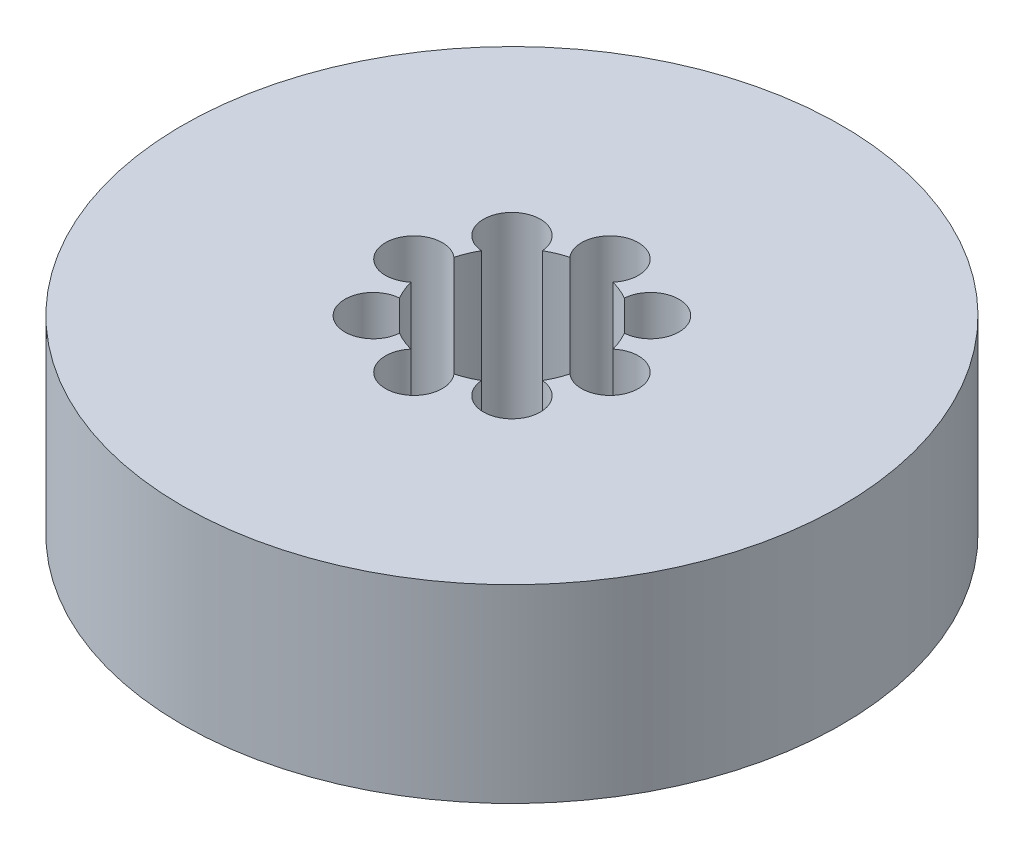
ISO-10303-21;
HEADER;
FILE_DESCRIPTION(('STEP AP214'),'2;1');
FILE_NAME('part.step','',(''),(''),'','','');
FILE_SCHEMA(('AUTOMOTIVE_DESIGN { 1 0 10303 214 1 1 1 1 }'));
ENDSEC;
DATA;
#1=APPLICATION_CONTEXT('core data for automotive mechanical design processes');
#2=APPLICATION_PROTOCOL_DEFINITION('international standard','automotive_design',2000,#1);
#3=PRODUCT_CONTEXT('',#1,'mechanical');
#4=PRODUCT('Part','Part','',(#3));
#5=PRODUCT_RELATED_PRODUCT_CATEGORY('part','',(#4));
#6=PRODUCT_DEFINITION_FORMATION('','',#4);
#7=PRODUCT_DEFINITION_CONTEXT('part definition',#1,'design');
#8=PRODUCT_DEFINITION('design','',#6,#7);
#9=PRODUCT_DEFINITION_SHAPE('','',#8);
#10=(LENGTH_UNIT() NAMED_UNIT(*) SI_UNIT(.MILLI.,.METRE.));
#11=(NAMED_UNIT(*) PLANE_ANGLE_UNIT() SI_UNIT($,.RADIAN.));
#12=(NAMED_UNIT(*) SI_UNIT($,.STERADIAN.) SOLID_ANGLE_UNIT());
#13=UNCERTAINTY_MEASURE_WITH_UNIT(LENGTH_MEASURE(1.E-05),#10,'distance_accuracy_value','');
#14=(GEOMETRIC_REPRESENTATION_CONTEXT(3) GLOBAL_UNCERTAINTY_ASSIGNED_CONTEXT((#13)) GLOBAL_UNIT_ASSIGNED_CONTEXT((#10,
#11,#12)) REPRESENTATION_CONTEXT('',''));
#15=CARTESIAN_POINT('',(0.,0.,0.));
#16=DIRECTION('',(0.,0.,1.));
#17=DIRECTION('',(1.,0.,0.));
#18=AXIS2_PLACEMENT_3D('',#15,#16,#17);
#19=CARTESIAN_POINT('',(0.,23.,0.));
#20=DIRECTION('',(0.,-1.,0.));
#21=DIRECTION('',(0.,0.,-1.));
#22=AXIS2_PLACEMENT_3D('',#19,#20,#21);
#23=CYLINDRICAL_SURFACE('',#22,40.);
#24=CARTESIAN_POINT('',(0.,23.,0.));
#25=DIRECTION('',(0.,1.,0.));
#26=DIRECTION('',(0.,0.,1.));
#27=AXIS2_PLACEMENT_3D('',#24,#25,#26);
#28=CIRCLE('',#27,40.);
#29=CARTESIAN_POINT('',(0.,23.,40.));
#30=VERTEX_POINT('',#29);
#31=EDGE_CURVE('E195',#30,#30,#28,.T.);
#32=ORIENTED_EDGE('',*,*,#31,.F.);
#33=EDGE_LOOP('',(#32));
#34=FACE_BOUND('',#33,.T.);
#35=CARTESIAN_POINT('',(0.,0.,0.));
#36=DIRECTION('',(0.,1.,0.));
#37=DIRECTION('',(0.,0.,1.));
#38=AXIS2_PLACEMENT_3D('',#35,#36,#37);
#39=CIRCLE('',#38,40.);
#40=CARTESIAN_POINT('',(0.,0.,40.));
#41=VERTEX_POINT('',#40);
#42=EDGE_CURVE('E179',#41,#41,#39,.T.);
#43=ORIENTED_EDGE('',*,*,#42,.T.);
#44=EDGE_LOOP('',(#43));
#45=FACE_BOUND('',#44,.T.);
#46=ADVANCED_FACE('F39',(#34,#45),#23,.T.);
#47=CARTESIAN_POINT('',(0.,23.,0.));
#48=DIRECTION('',(0.,1.,0.));
#49=DIRECTION('',(0.,0.,1.));
#50=AXIS2_PLACEMENT_3D('',#47,#48,#49);
#51=PLANE('',#50);
#52=CARTESIAN_POINT('',(0.,23.,11.898753026626));
#53=DIRECTION('',(0.,1.,0.));
#54=DIRECTION('',(1.,0.,0.));
#55=AXIS2_PLACEMENT_3D('',#52,#53,#54);
#56=CIRCLE('',#55,3.45048033420733);
#57=CARTESIAN_POINT('',(-2.61807628773734,23.,9.65120078288642));
#58=VERTEX_POINT('',#57);
#59=CARTESIAN_POINT('',(2.61807628773741,23.,9.6512007828864));
#60=VERTEX_POINT('',#59);
#61=EDGE_CURVE('E176',#58,#60,#56,.T.);
#62=ORIENTED_EDGE('',*,*,#61,.F.);
#63=CARTESIAN_POINT('',(0.,23.,0.));
#64=DIRECTION('',(0.,1.,0.));
#65=DIRECTION('',(0.,0.,1.));
#66=AXIS2_PLACEMENT_3D('',#63,#64,#65);
#67=CIRCLE('',#66,10.);
#68=CARTESIAN_POINT('',(-4.97317002344908,23.,8.67568901689471));
#69=VERTEX_POINT('',#68);
#70=EDGE_CURVE('E166',#69,#58,#67,.T.);
#71=ORIENTED_EDGE('',*,*,#70,.F.);
#72=CARTESIAN_POINT('',(-8.41368895279118,23.,8.41368895279121));
#73=DIRECTION('',(0.,1.,0.));
#74=DIRECTION('',(0.707106781186549,0.,0.707106781186546));
#75=AXIS2_PLACEMENT_3D('',#72,#73,#74);
#76=CIRCLE('',#75,3.45048033420733);
#77=CARTESIAN_POINT('',(-8.67568901689469,23.,4.97317002344911));
#78=VERTEX_POINT('',#77);
#79=EDGE_CURVE('E147',#78,#69,#76,.T.);
#80=ORIENTED_EDGE('',*,*,#79,.F.);
#81=CARTESIAN_POINT('',(-9.65120078288641,23.,2.61807628773738));
#82=VERTEX_POINT('',#81);
#83=EDGE_CURVE('E180',#82,#78,#67,.T.);
#84=ORIENTED_EDGE('',*,*,#83,.F.);
#85=CARTESIAN_POINT('',(-11.898753026626,23.,0.));
#86=DIRECTION('',(0.,1.,0.));
#87=DIRECTION('',(0.,0.,1.));
#88=AXIS2_PLACEMENT_3D('',#85,#86,#87);
#89=CIRCLE('',#88,3.45048033420733);
#90=CARTESIAN_POINT('',(-9.65120078288641,23.,-2.61807628773738));
#91=VERTEX_POINT('',#90);
#92=EDGE_CURVE('E186',#91,#82,#89,.T.);
#93=ORIENTED_EDGE('',*,*,#92,.F.);
#94=CARTESIAN_POINT('',(-8.67568901689476,23.,-4.97317002344899));
#95=VERTEX_POINT('',#94);
#96=EDGE_CURVE('E182',#95,#91,#67,.T.);
#97=ORIENTED_EDGE('',*,*,#96,.F.);
#98=CARTESIAN_POINT('',(-8.41368895279129,23.,-8.41368895279109));
#99=DIRECTION('',(0.,1.,0.));
#100=DIRECTION('',(-0.707106781186539,0.,0.707106781186556));
#101=AXIS2_PLACEMENT_3D('',#98,#99,#100);
#102=CIRCLE('',#101,3.45048033420733);
#103=CARTESIAN_POINT('',(-4.9731700234492,23.,-8.67568901689464));
#104=VERTEX_POINT('',#103);
#105=EDGE_CURVE('E446',#104,#95,#102,.T.);
#106=ORIENTED_EDGE('',*,*,#105,.F.);
#107=CARTESIAN_POINT('',(-2.61807628773748,23.,-9.65120078288638));
#108=VERTEX_POINT('',#107);
#109=EDGE_CURVE('E452',#108,#104,#67,.T.);
#110=ORIENTED_EDGE('',*,*,#109,.F.);
#111=CARTESIAN_POINT('',(-1.24632822443904E-13,23.,-11.898753026626));
#112=DIRECTION('',(0.,1.,0.));
#113=DIRECTION('',(-1.,0.,0.));
#114=AXIS2_PLACEMENT_3D('',#111,#112,#113);
#115=CIRCLE('',#114,3.45048033420733);
#116=CARTESIAN_POINT('',(2.61807628773728,23.,-9.65120078288644));
#117=VERTEX_POINT('',#116);
#118=EDGE_CURVE('E477',#117,#108,#115,.T.);
#119=ORIENTED_EDGE('',*,*,#118,.F.);
#120=CARTESIAN_POINT('',(4.97317002344902,23.,-8.67568901689474));
#121=VERTEX_POINT('',#120);
#122=EDGE_CURVE('E460',#121,#117,#67,.T.);
#123=ORIENTED_EDGE('',*,*,#122,.F.);
#124=CARTESIAN_POINT('',(8.41368895279112,23.,-8.41368895279127));
#125=DIRECTION('',(0.,1.,0.));
#126=DIRECTION('',(-0.707106781186554,0.,-0.707106781186541));
#127=AXIS2_PLACEMENT_3D('',#124,#125,#126);
#128=CIRCLE('',#127,3.45048033420733);
#129=CARTESIAN_POINT('',(8.67568901689466,23.,-4.97317002344917));
#130=VERTEX_POINT('',#129);
#131=EDGE_CURVE('E464',#130,#121,#128,.T.);
#132=ORIENTED_EDGE('',*,*,#131,.F.);
#133=CARTESIAN_POINT('',(9.65120078288641,23.,-2.61807628773738));
#134=VERTEX_POINT('',#133);
#135=EDGE_CURVE('E459',#134,#130,#67,.T.);
#136=ORIENTED_EDGE('',*,*,#135,.F.);
#137=CARTESIAN_POINT('',(11.898753026626,23.,0.));
#138=DIRECTION('',(0.,1.,0.));
#139=DIRECTION('',(0.,0.,-1.));
#140=AXIS2_PLACEMENT_3D('',#137,#138,#139);
#141=CIRCLE('',#140,3.45048033420733);
#142=CARTESIAN_POINT('',(9.65120078288641,23.,2.61807628773738));
#143=VERTEX_POINT('',#142);
#144=EDGE_CURVE('E469',#143,#134,#141,.T.);
#145=ORIENTED_EDGE('',*,*,#144,.F.);
#146=CARTESIAN_POINT('',(8.67568901689473,23.,4.97317002344905));
#147=VERTEX_POINT('',#146);
#148=EDGE_CURVE('E181',#147,#143,#67,.T.);
#149=ORIENTED_EDGE('',*,*,#148,.F.);
#150=CARTESIAN_POINT('',(8.41368895279123,23.,8.41368895279115));
#151=DIRECTION('',(0.,1.,0.));
#152=DIRECTION('',(0.707106781186544,0.,-0.707106781186551));
#153=AXIS2_PLACEMENT_3D('',#150,#151,#152);
#154=CIRCLE('',#153,3.45048033420733);
#155=CARTESIAN_POINT('',(4.97317002344914,23.,8.67568901689467));
#156=VERTEX_POINT('',#155);
#157=EDGE_CURVE('E475',#156,#147,#154,.T.);
#158=ORIENTED_EDGE('',*,*,#157,.F.);
#159=EDGE_CURVE('E177',#60,#156,#67,.T.);
#160=ORIENTED_EDGE('',*,*,#159,.F.);
#161=EDGE_LOOP('',(#62,#71,#80,#84,#93,#97,#106,#110,#119,#123,#132,#136,#145,#149,#158,#160));
#162=FACE_BOUND('',#161,.T.);
#163=ORIENTED_EDGE('',*,*,#31,.T.);
#164=EDGE_LOOP('',(#163));
#165=FACE_BOUND('',#164,.T.);
#166=ADVANCED_FACE('F172',(#162,#165),#51,.T.);
#167=CARTESIAN_POINT('',(0.,0.,0.));
#168=DIRECTION('',(0.,1.,0.));
#169=DIRECTION('',(0.,0.,1.));
#170=AXIS2_PLACEMENT_3D('',#167,#168,#169);
#171=PLANE('',#170);
#172=CARTESIAN_POINT('',(0.,0.,0.));
#173=DIRECTION('',(0.,1.,0.));
#174=DIRECTION('',(0.,0.,1.));
#175=AXIS2_PLACEMENT_3D('',#172,#173,#174);
#176=CIRCLE('',#175,10.);
#177=CARTESIAN_POINT('',(0.,0.,10.));
#178=VERTEX_POINT('',#177);
#179=EDGE_CURVE('E187',#178,#178,#176,.T.);
#180=ORIENTED_EDGE('',*,*,#179,.T.);
#181=EDGE_LOOP('',(#180));
#182=FACE_BOUND('',#181,.T.);
#183=ORIENTED_EDGE('',*,*,#42,.F.);
#184=EDGE_LOOP('',(#183));
#185=FACE_BOUND('',#184,.T.);
#186=ADVANCED_FACE('F270',(#182,#185),#171,.F.);
#187=CARTESIAN_POINT('',(0.,23.,0.));
#188=DIRECTION('',(0.,-1.,0.));
#189=DIRECTION('',(0.,0.,-1.));
#190=AXIS2_PLACEMENT_3D('',#187,#188,#189);
#191=CYLINDRICAL_SURFACE('',#190,10.);
#192=DIRECTION('',(0.,1.,0.));
#193=VECTOR('',#192,1.);
#194=CARTESIAN_POINT('',(-2.61807628773734,11.8621132783256,9.65120078288642));
#195=LINE('',#194,#193);
#196=CARTESIAN_POINT('',(-2.61807628773734,0.724226556651223,9.65120078288642));
#197=VERTEX_POINT('',#196);
#198=EDGE_CURVE('E11',#197,#58,#195,.T.);
#199=ORIENTED_EDGE('',*,*,#198,.F.);
#200=CARTESIAN_POINT('',(0.,0.724226556651223,0.));
#201=DIRECTION('',(0.,1.,0.));
#202=DIRECTION('',(0.,0.,1.));
#203=AXIS2_PLACEMENT_3D('',#200,#201,#202);
#204=CIRCLE('',#203,10.);
#205=CARTESIAN_POINT('',(2.61807628773741,0.724226556651223,9.6512007828864));
#206=VERTEX_POINT('',#205);
#207=EDGE_CURVE('E250',#197,#206,#204,.T.);
#208=ORIENTED_EDGE('',*,*,#207,.T.);
#209=DIRECTION('',(0.,1.,0.));
#210=VECTOR('',#209,1.);
#211=CARTESIAN_POINT('',(2.61807628773741,11.8621132783256,9.6512007828864));
#212=LINE('',#211,#210);
#213=EDGE_CURVE('E46',#60,#206,#212,.F.);
#214=ORIENTED_EDGE('',*,*,#213,.F.);
#215=ORIENTED_EDGE('',*,*,#159,.T.);
#216=DIRECTION('',(0.,1.,0.));
#217=VECTOR('',#216,1.);
#218=CARTESIAN_POINT('',(4.97317002344914,11.8621132783256,8.67568901689467));
#219=LINE('',#218,#217);
#220=CARTESIAN_POINT('',(4.97317002344914,0.724226556651223,8.67568901689467));
#221=VERTEX_POINT('',#220);
#222=EDGE_CURVE('E244',#221,#156,#219,.T.);
#223=ORIENTED_EDGE('',*,*,#222,.F.);
#224=CARTESIAN_POINT('',(0.,0.724226556651223,0.));
#225=DIRECTION('',(0.,1.,0.));
#226=DIRECTION('',(0.,0.,1.));
#227=AXIS2_PLACEMENT_3D('',#224,#225,#226);
#228=CIRCLE('',#227,10.);
#229=CARTESIAN_POINT('',(8.67568901689473,0.724226556651223,4.97317002344905));
#230=VERTEX_POINT('',#229);
#231=EDGE_CURVE('E238',#221,#230,#228,.T.);
#232=ORIENTED_EDGE('',*,*,#231,.T.);
#233=DIRECTION('',(0.,1.,0.));
#234=VECTOR('',#233,1.);
#235=CARTESIAN_POINT('',(8.67568901689473,11.8621132783256,4.97317002344905));
#236=LINE('',#235,#234);
#237=EDGE_CURVE('E242',#147,#230,#236,.F.);
#238=ORIENTED_EDGE('',*,*,#237,.F.);
#239=ORIENTED_EDGE('',*,*,#148,.T.);
#240=DIRECTION('',(0.,1.,0.));
#241=VECTOR('',#240,1.);
#242=CARTESIAN_POINT('',(9.65120078288641,11.8621132783256,2.61807628773738));
#243=LINE('',#242,#241);
#244=CARTESIAN_POINT('',(9.65120078288641,0.724226556651223,2.61807628773738));
#245=VERTEX_POINT('',#244);
#246=EDGE_CURVE('E236',#245,#143,#243,.T.);
#247=ORIENTED_EDGE('',*,*,#246,.F.);
#248=CARTESIAN_POINT('',(0.,0.724226556651223,0.));
#249=DIRECTION('',(0.,1.,0.));
#250=DIRECTION('',(0.,0.,1.));
#251=AXIS2_PLACEMENT_3D('',#248,#249,#250);
#252=CIRCLE('',#251,10.);
#253=CARTESIAN_POINT('',(9.65120078288641,0.724226556651223,-2.61807628773738));
#254=VERTEX_POINT('',#253);
#255=EDGE_CURVE('E235',#245,#254,#252,.T.);
#256=ORIENTED_EDGE('',*,*,#255,.T.);
#257=DIRECTION('',(0.,1.,0.));
#258=VECTOR('',#257,1.);
#259=CARTESIAN_POINT('',(9.65120078288641,11.8621132783256,-2.61807628773738));
#260=LINE('',#259,#258);
#261=EDGE_CURVE('E234',#134,#254,#260,.F.);
#262=ORIENTED_EDGE('',*,*,#261,.F.);
#263=ORIENTED_EDGE('',*,*,#135,.T.);
#264=DIRECTION('',(0.,1.,0.));
#265=VECTOR('',#264,1.);
#266=CARTESIAN_POINT('',(8.67568901689466,11.8621132783256,-4.97317002344917));
#267=LINE('',#266,#265);
#268=CARTESIAN_POINT('',(8.67568901689466,0.724226556651223,-4.97317002344917));
#269=VERTEX_POINT('',#268);
#270=EDGE_CURVE('E229',#269,#130,#267,.T.);
#271=ORIENTED_EDGE('',*,*,#270,.F.);
#272=CARTESIAN_POINT('',(0.,0.724226556651223,0.));
#273=DIRECTION('',(0.,1.,0.));
#274=DIRECTION('',(0.,0.,1.));
#275=AXIS2_PLACEMENT_3D('',#272,#273,#274);
#276=CIRCLE('',#275,10.);
#277=CARTESIAN_POINT('',(4.97317002344902,0.724226556651223,-8.67568901689474));
#278=VERTEX_POINT('',#277);
#279=EDGE_CURVE('E221',#269,#278,#276,.T.);
#280=ORIENTED_EDGE('',*,*,#279,.T.);
#281=DIRECTION('',(0.,1.,0.));
#282=VECTOR('',#281,1.);
#283=CARTESIAN_POINT('',(4.97317002344902,11.8621132783256,-8.67568901689475));
#284=LINE('',#283,#282);
#285=EDGE_CURVE('E230',#121,#278,#284,.F.);
#286=ORIENTED_EDGE('',*,*,#285,.F.);
#287=ORIENTED_EDGE('',*,*,#122,.T.);
#288=DIRECTION('',(0.,1.,0.));
#289=VECTOR('',#288,1.);
#290=CARTESIAN_POINT('',(2.61807628773728,11.8621132783256,-9.65120078288644));
#291=LINE('',#290,#289);
#292=CARTESIAN_POINT('',(2.61807628773728,0.724226556651223,-9.65120078288644));
#293=VERTEX_POINT('',#292);
#294=EDGE_CURVE('E225',#293,#117,#291,.T.);
#295=ORIENTED_EDGE('',*,*,#294,.F.);
#296=CARTESIAN_POINT('',(0.,0.724226556651223,0.));
#297=DIRECTION('',(0.,1.,0.));
#298=DIRECTION('',(0.,0.,1.));
#299=AXIS2_PLACEMENT_3D('',#296,#297,#298);
#300=CIRCLE('',#299,10.);
#301=CARTESIAN_POINT('',(-2.61807628773748,0.724226556651223,-9.65120078288638));
#302=VERTEX_POINT('',#301);
#303=EDGE_CURVE('E216',#293,#302,#300,.T.);
#304=ORIENTED_EDGE('',*,*,#303,.T.);
#305=DIRECTION('',(0.,1.,0.));
#306=VECTOR('',#305,1.);
#307=CARTESIAN_POINT('',(-2.61807628773748,11.8621132783256,-9.65120078288638));
#308=LINE('',#307,#306);
#309=EDGE_CURVE('E218',#108,#302,#308,.F.);
#310=ORIENTED_EDGE('',*,*,#309,.F.);
#311=ORIENTED_EDGE('',*,*,#109,.T.);
#312=DIRECTION('',(0.,1.,0.));
#313=VECTOR('',#312,1.);
#314=CARTESIAN_POINT('',(-4.9731700234492,11.8621132783256,-8.67568901689464));
#315=LINE('',#314,#313);
#316=CARTESIAN_POINT('',(-4.9731700234492,0.724226556651223,-8.67568901689464));
#317=VERTEX_POINT('',#316);
#318=EDGE_CURVE('E212',#317,#104,#315,.T.);
#319=ORIENTED_EDGE('',*,*,#318,.F.);
#320=CARTESIAN_POINT('',(0.,0.724226556651223,0.));
#321=DIRECTION('',(0.,1.,0.));
#322=DIRECTION('',(0.,0.,1.));
#323=AXIS2_PLACEMENT_3D('',#320,#321,#322);
#324=CIRCLE('',#323,10.);
#325=CARTESIAN_POINT('',(-8.67568901689476,0.724226556651223,-4.97317002344899));
#326=VERTEX_POINT('',#325);
#327=EDGE_CURVE('E208',#317,#326,#324,.T.);
#328=ORIENTED_EDGE('',*,*,#327,.T.);
#329=DIRECTION('',(0.,1.,0.));
#330=VECTOR('',#329,1.);
#331=CARTESIAN_POINT('',(-8.67568901689476,11.8621132783256,-4.97317002344899));
#332=LINE('',#331,#330);
#333=EDGE_CURVE('E211',#95,#326,#332,.F.);
#334=ORIENTED_EDGE('',*,*,#333,.F.);
#335=ORIENTED_EDGE('',*,*,#96,.T.);
#336=DIRECTION('',(0.,1.,0.));
#337=VECTOR('',#336,1.);
#338=CARTESIAN_POINT('',(-9.65120078288641,11.8621132783256,-2.61807628773738));
#339=LINE('',#338,#337);
#340=CARTESIAN_POINT('',(-9.65120078288641,0.724226556651223,-2.61807628773738));
#341=VERTEX_POINT('',#340);
#342=EDGE_CURVE('E201',#341,#91,#339,.T.);
#343=ORIENTED_EDGE('',*,*,#342,.F.);
#344=CARTESIAN_POINT('',(0.,0.724226556651223,0.));
#345=DIRECTION('',(0.,1.,0.));
#346=DIRECTION('',(0.,0.,1.));
#347=AXIS2_PLACEMENT_3D('',#344,#345,#346);
#348=CIRCLE('',#347,10.);
#349=CARTESIAN_POINT('',(-9.65120078288641,0.724226556651223,2.61807628773738));
#350=VERTEX_POINT('',#349);
#351=EDGE_CURVE('E194',#341,#350,#348,.T.);
#352=ORIENTED_EDGE('',*,*,#351,.T.);
#353=DIRECTION('',(0.,1.,0.));
#354=VECTOR('',#353,1.);
#355=CARTESIAN_POINT('',(-9.65120078288641,11.8621132783256,2.61807628773738));
#356=LINE('',#355,#354);
#357=EDGE_CURVE('E199',#82,#350,#356,.F.);
#358=ORIENTED_EDGE('',*,*,#357,.F.);
#359=ORIENTED_EDGE('',*,*,#83,.T.);
#360=DIRECTION('',(0.,1.,0.));
#361=VECTOR('',#360,1.);
#362=CARTESIAN_POINT('',(-8.67568901689469,11.8621132783256,4.97317002344911));
#363=LINE('',#362,#361);
#364=CARTESIAN_POINT('',(-8.67568901689469,0.724226556651223,4.97317002344911));
#365=VERTEX_POINT('',#364);
#366=EDGE_CURVE('E160',#365,#78,#363,.T.);
#367=ORIENTED_EDGE('',*,*,#366,.F.);
#368=CARTESIAN_POINT('',(0.,0.724226556651223,0.));
#369=DIRECTION('',(0.,1.,0.));
#370=DIRECTION('',(0.,0.,1.));
#371=AXIS2_PLACEMENT_3D('',#368,#369,#370);
#372=CIRCLE('',#371,10.);
#373=CARTESIAN_POINT('',(-4.97317002344908,0.724226556651223,8.67568901689471));
#374=VERTEX_POINT('',#373);
#375=EDGE_CURVE('E168',#365,#374,#372,.T.);
#376=ORIENTED_EDGE('',*,*,#375,.T.);
#377=DIRECTION('',(0.,1.,0.));
#378=VECTOR('',#377,1.);
#379=CARTESIAN_POINT('',(-4.97317002344908,11.8621132783256,8.67568901689471));
#380=LINE('',#379,#378);
#381=EDGE_CURVE('E152',#69,#374,#380,.F.);
#382=ORIENTED_EDGE('',*,*,#381,.F.);
#383=ORIENTED_EDGE('',*,*,#70,.T.);
#384=EDGE_LOOP('',(#199,#208,#214,#215,#223,#232,#238,#239,#247,#256,#262,#263,#271,#280,#286,
#287,#295,#304,#310,#311,#319,#328,#334,#335,#343,#352,#358,#359,#367,#376,#382,#383));
#385=FACE_BOUND('',#384,.T.);
#386=ORIENTED_EDGE('',*,*,#179,.F.);
#387=EDGE_LOOP('',(#386));
#388=FACE_BOUND('',#387,.T.);
#389=ADVANCED_FACE('F170',(#385,#388),#191,.F.);
#390=CARTESIAN_POINT('',(-11.898753026626,0.724226556651223,0.));
#391=DIRECTION('',(0.,1.,0.));
#392=DIRECTION('',(0.,0.,1.));
#393=AXIS2_PLACEMENT_3D('',#390,#391,#392);
#394=CYLINDRICAL_SURFACE('',#393,3.45048033420733);
#395=ORIENTED_EDGE('',*,*,#342,.T.);
#396=ORIENTED_EDGE('',*,*,#92,.T.);
#397=ORIENTED_EDGE('',*,*,#357,.T.);
#398=CARTESIAN_POINT('',(-11.898753026626,0.724226556651223,0.));
#399=DIRECTION('',(0.,1.,0.));
#400=DIRECTION('',(0.,0.,1.));
#401=AXIS2_PLACEMENT_3D('',#398,#399,#400);
#402=CIRCLE('',#401,3.45048033420733);
#403=EDGE_CURVE('E191',#341,#350,#402,.T.);
#404=ORIENTED_EDGE('',*,*,#403,.F.);
#405=EDGE_LOOP('',(#395,#396,#397,#404));
#406=FACE_BOUND('',#405,.T.);
#407=ADVANCED_FACE('F279',(#406),#394,.F.);
#408=CARTESIAN_POINT('',(-11.898753026626,0.724226556651223,0.));
#409=DIRECTION('',(0.,1.,0.));
#410=DIRECTION('',(0.,0.,1.));
#411=AXIS2_PLACEMENT_3D('',#408,#409,#410);
#412=PLANE('',#411);
#413=ORIENTED_EDGE('',*,*,#403,.T.);
#414=ORIENTED_EDGE('',*,*,#351,.F.);
#415=EDGE_LOOP('',(#413,#414));
#416=FACE_BOUND('',#415,.T.);
#417=ADVANCED_FACE('F285',(#416),#412,.T.);
#418=CARTESIAN_POINT('',(-8.41368895279118,0.724226556651223,8.41368895279121));
#419=DIRECTION('',(0.,1.,0.));
#420=DIRECTION('',(0.,0.,1.));
#421=AXIS2_PLACEMENT_3D('',#418,#419,#420);
#422=CYLINDRICAL_SURFACE('',#421,3.45048033420733);
#423=ORIENTED_EDGE('',*,*,#366,.T.);
#424=ORIENTED_EDGE('',*,*,#79,.T.);
#425=ORIENTED_EDGE('',*,*,#381,.T.);
#426=CARTESIAN_POINT('',(-8.41368895279118,0.724226556651223,8.41368895279121));
#427=DIRECTION('',(0.,1.,0.));
#428=DIRECTION('',(0.707106781186549,0.,0.707106781186546));
#429=AXIS2_PLACEMENT_3D('',#426,#427,#428);
#430=CIRCLE('',#429,3.45048033420733);
#431=EDGE_CURVE('E165',#365,#374,#430,.T.);
#432=ORIENTED_EDGE('',*,*,#431,.F.);
#433=EDGE_LOOP('',(#423,#424,#425,#432));
#434=FACE_BOUND('',#433,.T.);
#435=ADVANCED_FACE('F155',(#434),#422,.F.);
#436=CARTESIAN_POINT('',(-8.41368895279118,0.724226556651223,8.41368895279121));
#437=DIRECTION('',(0.,1.,0.));
#438=DIRECTION('',(0.707106781186549,0.,0.707106781186546));
#439=AXIS2_PLACEMENT_3D('',#436,#437,#438);
#440=PLANE('',#439);
#441=ORIENTED_EDGE('',*,*,#431,.T.);
#442=ORIENTED_EDGE('',*,*,#375,.F.);
#443=EDGE_LOOP('',(#441,#442));
#444=FACE_BOUND('',#443,.T.);
#445=ADVANCED_FACE('F288',(#444),#440,.T.);
#446=CARTESIAN_POINT('',(-8.41368895279129,0.724226556651223,-8.41368895279109));
#447=DIRECTION('',(0.,1.,0.));
#448=DIRECTION('',(0.,0.,1.));
#449=AXIS2_PLACEMENT_3D('',#446,#447,#448);
#450=CYLINDRICAL_SURFACE('',#449,3.45048033420733);
#451=ORIENTED_EDGE('',*,*,#318,.T.);
#452=ORIENTED_EDGE('',*,*,#105,.T.);
#453=ORIENTED_EDGE('',*,*,#333,.T.);
#454=CARTESIAN_POINT('',(-8.41368895279129,0.724226556651223,-8.41368895279109));
#455=DIRECTION('',(0.,1.,0.));
#456=DIRECTION('',(-0.707106781186539,0.,0.707106781186556));
#457=AXIS2_PLACEMENT_3D('',#454,#455,#456);
#458=CIRCLE('',#457,3.45048033420733);
#459=EDGE_CURVE('E447',#317,#326,#458,.T.);
#460=ORIENTED_EDGE('',*,*,#459,.F.);
#461=EDGE_LOOP('',(#451,#452,#453,#460));
#462=FACE_BOUND('',#461,.T.);
#463=ADVANCED_FACE('F295',(#462),#450,.F.);
#464=CARTESIAN_POINT('',(-8.41368895279129,0.724226556651223,-8.41368895279109));
#465=DIRECTION('',(0.,1.,0.));
#466=DIRECTION('',(-0.707106781186539,0.,0.707106781186556));
#467=AXIS2_PLACEMENT_3D('',#464,#465,#466);
#468=PLANE('',#467);
#469=ORIENTED_EDGE('',*,*,#459,.T.);
#470=ORIENTED_EDGE('',*,*,#327,.F.);
#471=EDGE_LOOP('',(#469,#470));
#472=FACE_BOUND('',#471,.T.);
#473=ADVANCED_FACE('F375',(#472),#468,.T.);
#474=CARTESIAN_POINT('',(-1.24632822443904E-13,0.724226556651223,-11.898753026626));
#475=DIRECTION('',(0.,1.,0.));
#476=DIRECTION('',(0.,0.,1.));
#477=AXIS2_PLACEMENT_3D('',#474,#475,#476);
#478=CYLINDRICAL_SURFACE('',#477,3.45048033420733);
#479=ORIENTED_EDGE('',*,*,#294,.T.);
#480=ORIENTED_EDGE('',*,*,#118,.T.);
#481=ORIENTED_EDGE('',*,*,#309,.T.);
#482=CARTESIAN_POINT('',(-1.24632822443904E-13,0.724226556651223,-11.898753026626));
#483=DIRECTION('',(0.,1.,0.));
#484=DIRECTION('',(-1.,0.,0.));
#485=AXIS2_PLACEMENT_3D('',#482,#483,#484);
#486=CIRCLE('',#485,3.45048033420733);
#487=EDGE_CURVE('E467',#293,#302,#486,.T.);
#488=ORIENTED_EDGE('',*,*,#487,.F.);
#489=EDGE_LOOP('',(#479,#480,#481,#488));
#490=FACE_BOUND('',#489,.T.);
#491=ADVANCED_FACE('F361',(#490),#478,.F.);
#492=CARTESIAN_POINT('',(-1.24632822443904E-13,0.724226556651223,-11.898753026626));
#493=DIRECTION('',(0.,1.,0.));
#494=DIRECTION('',(-1.,0.,0.));
#495=AXIS2_PLACEMENT_3D('',#492,#493,#494);
#496=PLANE('',#495);
#497=ORIENTED_EDGE('',*,*,#487,.T.);
#498=ORIENTED_EDGE('',*,*,#303,.F.);
#499=EDGE_LOOP('',(#497,#498));
#500=FACE_BOUND('',#499,.T.);
#501=ADVANCED_FACE('F297',(#500),#496,.T.);
#502=CARTESIAN_POINT('',(8.41368895279112,0.724226556651223,-8.41368895279127));
#503=DIRECTION('',(0.,1.,0.));
#504=DIRECTION('',(0.,0.,1.));
#505=AXIS2_PLACEMENT_3D('',#502,#503,#504);
#506=CYLINDRICAL_SURFACE('',#505,3.45048033420733);
#507=ORIENTED_EDGE('',*,*,#270,.T.);
#508=ORIENTED_EDGE('',*,*,#131,.T.);
#509=ORIENTED_EDGE('',*,*,#285,.T.);
#510=CARTESIAN_POINT('',(8.41368895279112,0.724226556651223,-8.41368895279127));
#511=DIRECTION('',(0.,1.,0.));
#512=DIRECTION('',(-0.707106781186554,0.,-0.707106781186541));
#513=AXIS2_PLACEMENT_3D('',#510,#511,#512);
#514=CIRCLE('',#513,3.45048033420733);
#515=EDGE_CURVE('E470',#269,#278,#514,.T.);
#516=ORIENTED_EDGE('',*,*,#515,.F.);
#517=EDGE_LOOP('',(#507,#508,#509,#516));
#518=FACE_BOUND('',#517,.T.);
#519=ADVANCED_FACE('F294',(#518),#506,.F.);
#520=CARTESIAN_POINT('',(8.41368895279112,0.724226556651223,-8.41368895279127));
#521=DIRECTION('',(0.,1.,0.));
#522=DIRECTION('',(-0.707106781186554,0.,-0.707106781186541));
#523=AXIS2_PLACEMENT_3D('',#520,#521,#522);
#524=PLANE('',#523);
#525=ORIENTED_EDGE('',*,*,#515,.T.);
#526=ORIENTED_EDGE('',*,*,#279,.F.);
#527=EDGE_LOOP('',(#525,#526));
#528=FACE_BOUND('',#527,.T.);
#529=ADVANCED_FACE('F300',(#528),#524,.T.);
#530=CARTESIAN_POINT('',(11.898753026626,0.724226556651223,0.));
#531=DIRECTION('',(0.,1.,0.));
#532=DIRECTION('',(0.,0.,1.));
#533=AXIS2_PLACEMENT_3D('',#530,#531,#532);
#534=CYLINDRICAL_SURFACE('',#533,3.45048033420733);
#535=ORIENTED_EDGE('',*,*,#246,.T.);
#536=ORIENTED_EDGE('',*,*,#144,.T.);
#537=ORIENTED_EDGE('',*,*,#261,.T.);
#538=CARTESIAN_POINT('',(11.898753026626,0.724226556651223,0.));
#539=DIRECTION('',(0.,1.,0.));
#540=DIRECTION('',(0.,0.,-1.));
#541=AXIS2_PLACEMENT_3D('',#538,#539,#540);
#542=CIRCLE('',#541,3.45048033420733);
#543=EDGE_CURVE('E472',#245,#254,#542,.T.);
#544=ORIENTED_EDGE('',*,*,#543,.F.);
#545=EDGE_LOOP('',(#535,#536,#537,#544));
#546=FACE_BOUND('',#545,.T.);
#547=ADVANCED_FACE('F305',(#546),#534,.F.);
#548=CARTESIAN_POINT('',(11.898753026626,0.724226556651223,0.));
#549=DIRECTION('',(0.,1.,0.));
#550=DIRECTION('',(0.,0.,-1.));
#551=AXIS2_PLACEMENT_3D('',#548,#549,#550);
#552=PLANE('',#551);
#553=ORIENTED_EDGE('',*,*,#543,.T.);
#554=ORIENTED_EDGE('',*,*,#255,.F.);
#555=EDGE_LOOP('',(#553,#554));
#556=FACE_BOUND('',#555,.T.);
#557=ADVANCED_FACE('F308',(#556),#552,.T.);
#558=CARTESIAN_POINT('',(8.41368895279123,0.724226556651223,8.41368895279115));
#559=DIRECTION('',(0.,1.,0.));
#560=DIRECTION('',(0.,0.,1.));
#561=AXIS2_PLACEMENT_3D('',#558,#559,#560);
#562=CYLINDRICAL_SURFACE('',#561,3.45048033420733);
#563=ORIENTED_EDGE('',*,*,#222,.T.);
#564=ORIENTED_EDGE('',*,*,#157,.T.);
#565=ORIENTED_EDGE('',*,*,#237,.T.);
#566=CARTESIAN_POINT('',(8.41368895279123,0.724226556651223,8.41368895279115));
#567=DIRECTION('',(0.,1.,0.));
#568=DIRECTION('',(0.707106781186544,0.,-0.707106781186551));
#569=AXIS2_PLACEMENT_3D('',#566,#567,#568);
#570=CIRCLE('',#569,3.45048033420733);
#571=EDGE_CURVE('E56',#221,#230,#570,.T.);
#572=ORIENTED_EDGE('',*,*,#571,.F.);
#573=EDGE_LOOP('',(#563,#564,#565,#572));
#574=FACE_BOUND('',#573,.T.);
#575=ADVANCED_FACE('F309',(#574),#562,.F.);
#576=CARTESIAN_POINT('',(8.41368895279123,0.724226556651223,8.41368895279115));
#577=DIRECTION('',(0.,1.,0.));
#578=DIRECTION('',(0.707106781186544,0.,-0.707106781186551));
#579=AXIS2_PLACEMENT_3D('',#576,#577,#578);
#580=PLANE('',#579);
#581=ORIENTED_EDGE('',*,*,#571,.T.);
#582=ORIENTED_EDGE('',*,*,#231,.F.);
#583=EDGE_LOOP('',(#581,#582));
#584=FACE_BOUND('',#583,.T.);
#585=ADVANCED_FACE('F256',(#584),#580,.T.);
#586=CARTESIAN_POINT('',(0.,0.724226556651223,11.898753026626));
#587=DIRECTION('',(0.,1.,0.));
#588=DIRECTION('',(0.,0.,1.));
#589=AXIS2_PLACEMENT_3D('',#586,#587,#588);
#590=CYLINDRICAL_SURFACE('',#589,3.45048033420733);
#591=ORIENTED_EDGE('',*,*,#198,.T.);
#592=ORIENTED_EDGE('',*,*,#61,.T.);
#593=ORIENTED_EDGE('',*,*,#213,.T.);
#594=CARTESIAN_POINT('',(0.,0.724226556651223,11.898753026626));
#595=DIRECTION('',(0.,1.,0.));
#596=DIRECTION('',(1.,0.,0.));
#597=AXIS2_PLACEMENT_3D('',#594,#595,#596);
#598=CIRCLE('',#597,3.45048033420733);
#599=EDGE_CURVE('E55',#197,#206,#598,.T.);
#600=ORIENTED_EDGE('',*,*,#599,.F.);
#601=EDGE_LOOP('',(#591,#592,#593,#600));
#602=FACE_BOUND('',#601,.T.);
#603=ADVANCED_FACE('F253',(#602),#590,.F.);
#604=CARTESIAN_POINT('',(0.,0.724226556651223,11.898753026626));
#605=DIRECTION('',(0.,1.,0.));
#606=DIRECTION('',(1.,0.,0.));
#607=AXIS2_PLACEMENT_3D('',#604,#605,#606);
#608=PLANE('',#607);
#609=ORIENTED_EDGE('',*,*,#599,.T.);
#610=ORIENTED_EDGE('',*,*,#207,.F.);
#611=EDGE_LOOP('',(#609,#610));
#612=FACE_BOUND('',#611,.T.);
#613=ADVANCED_FACE('F252',(#612),#608,.T.);
#614=CLOSED_SHELL('',(#46,#166,#186,#389,#407,#417,#435,#445,#463,#473,#491,#501,#519,#529,#547,
#557,#575,#585,#603,#613));
#615=MANIFOLD_SOLID_BREP('B2',#614);
#616=ADVANCED_BREP_SHAPE_REPRESENTATION('',(#18,#615),#14);
#617=SHAPE_DEFINITION_REPRESENTATION(#9,#616);
ENDSEC;
END-ISO-10303-21;
